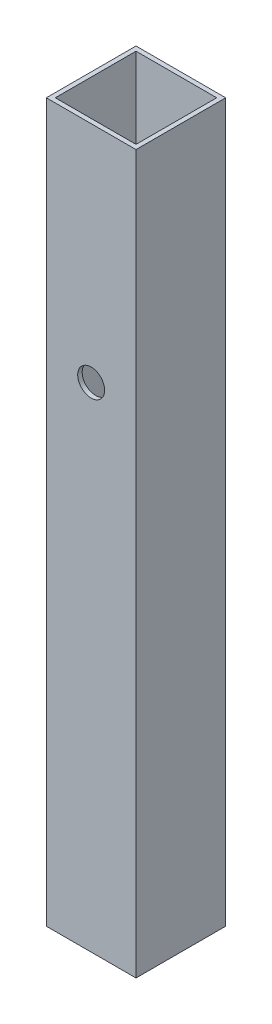
ISO-10303-21;
HEADER;
FILE_DESCRIPTION(('STEP AP214'),'2;1');
FILE_NAME('part.step','',(''),(''),'','','');
FILE_SCHEMA(('AUTOMOTIVE_DESIGN { 1 0 10303 214 1 1 1 1 }'));
ENDSEC;
DATA;
#1=APPLICATION_CONTEXT('core data for automotive mechanical design processes');
#2=APPLICATION_PROTOCOL_DEFINITION('international standard','automotive_design',2000,#1);
#3=PRODUCT_CONTEXT('',#1,'mechanical');
#4=PRODUCT('Part','Part','',(#3));
#5=PRODUCT_RELATED_PRODUCT_CATEGORY('part','',(#4));
#6=PRODUCT_DEFINITION_FORMATION('','',#4);
#7=PRODUCT_DEFINITION_CONTEXT('part definition',#1,'design');
#8=PRODUCT_DEFINITION('design','',#6,#7);
#9=PRODUCT_DEFINITION_SHAPE('','',#8);
#10=(LENGTH_UNIT() NAMED_UNIT(*) SI_UNIT(.MILLI.,.METRE.));
#11=(NAMED_UNIT(*) PLANE_ANGLE_UNIT() SI_UNIT($,.RADIAN.));
#12=(NAMED_UNIT(*) SI_UNIT($,.STERADIAN.) SOLID_ANGLE_UNIT());
#13=UNCERTAINTY_MEASURE_WITH_UNIT(LENGTH_MEASURE(1.E-05),#10,'distance_accuracy_value','');
#14=(GEOMETRIC_REPRESENTATION_CONTEXT(3) GLOBAL_UNCERTAINTY_ASSIGNED_CONTEXT((#13)) GLOBAL_UNIT_ASSIGNED_CONTEXT((#10,
#11,#12)) REPRESENTATION_CONTEXT('',''));
#15=CARTESIAN_POINT('',(0.,0.,0.));
#16=DIRECTION('',(0.,0.,1.));
#17=DIRECTION('',(1.,0.,0.));
#18=AXIS2_PLACEMENT_3D('',#15,#16,#17);
#19=CARTESIAN_POINT('',(0.,140.,0.));
#20=DIRECTION('',(0.,1.,0.));
#21=DIRECTION('',(0.,0.,1.));
#22=AXIS2_PLACEMENT_3D('',#19,#20,#21);
#23=PLANE('',#22);
#24=DIRECTION('',(0.,0.,1.));
#25=VECTOR('',#24,1.);
#26=CARTESIAN_POINT('',(-10.,140.,-10.));
#27=LINE('',#26,#25);
#28=CARTESIAN_POINT('',(-10.,140.,-10.));
#29=VERTEX_POINT('',#28);
#30=CARTESIAN_POINT('',(-9.99999999999999,140.,10.));
#31=VERTEX_POINT('',#30);
#32=EDGE_CURVE('E105',#29,#31,#27,.T.);
#33=ORIENTED_EDGE('',*,*,#32,.T.);
#34=DIRECTION('',(1.,0.,0.));
#35=VECTOR('',#34,1.);
#36=CARTESIAN_POINT('',(-9.99999999999999,140.,10.));
#37=LINE('',#36,#35);
#38=CARTESIAN_POINT('',(10.,140.,10.));
#39=VERTEX_POINT('',#38);
#40=EDGE_CURVE('E158',#31,#39,#37,.T.);
#41=ORIENTED_EDGE('',*,*,#40,.T.);
#42=DIRECTION('',(0.,0.,-1.));
#43=VECTOR('',#42,1.);
#44=CARTESIAN_POINT('',(10.,140.,-10.));
#45=LINE('',#44,#43);
#46=CARTESIAN_POINT('',(10.,140.,-10.));
#47=VERTEX_POINT('',#46);
#48=EDGE_CURVE('E160',#39,#47,#45,.T.);
#49=ORIENTED_EDGE('',*,*,#48,.T.);
#50=DIRECTION('',(-1.,0.,0.));
#51=VECTOR('',#50,1.);
#52=CARTESIAN_POINT('',(-10.,140.,-10.));
#53=LINE('',#52,#51);
#54=EDGE_CURVE('E58',#47,#29,#53,.T.);
#55=ORIENTED_EDGE('',*,*,#54,.T.);
#56=EDGE_LOOP('',(#33,#41,#49,#55));
#57=FACE_BOUND('',#56,.T.);
#58=DIRECTION('',(1.,0.,0.));
#59=VECTOR('',#58,1.);
#60=CARTESIAN_POINT('',(-9.,140.,9.));
#61=LINE('',#60,#59);
#62=CARTESIAN_POINT('',(-9.,140.,9.));
#63=VERTEX_POINT('',#62);
#64=CARTESIAN_POINT('',(9.00000000000001,140.,9.));
#65=VERTEX_POINT('',#64);
#66=EDGE_CURVE('E132',#63,#65,#61,.T.);
#67=ORIENTED_EDGE('',*,*,#66,.F.);
#68=DIRECTION('',(0.,0.,1.));
#69=VECTOR('',#68,1.);
#70=CARTESIAN_POINT('',(-9.,140.,-9.));
#71=LINE('',#70,#69);
#72=CARTESIAN_POINT('',(-9.,140.,-9.));
#73=VERTEX_POINT('',#72);
#74=EDGE_CURVE('E130',#73,#63,#71,.T.);
#75=ORIENTED_EDGE('',*,*,#74,.F.);
#76=DIRECTION('',(-1.,0.,0.));
#77=VECTOR('',#76,1.);
#78=CARTESIAN_POINT('',(-9.,140.,-9.));
#79=LINE('',#78,#77);
#80=CARTESIAN_POINT('',(9.,140.,-9.));
#81=VERTEX_POINT('',#80);
#82=EDGE_CURVE('E137',#81,#73,#79,.T.);
#83=ORIENTED_EDGE('',*,*,#82,.F.);
#84=DIRECTION('',(0.,0.,-1.));
#85=VECTOR('',#84,1.);
#86=CARTESIAN_POINT('',(9.,140.,-9.));
#87=LINE('',#86,#85);
#88=EDGE_CURVE('E135',#65,#81,#87,.T.);
#89=ORIENTED_EDGE('',*,*,#88,.F.);
#90=EDGE_LOOP('',(#67,#75,#83,#89));
#91=FACE_BOUND('',#90,.T.);
#92=ADVANCED_FACE('F34',(#57,#91),#23,.T.);
#93=CARTESIAN_POINT('',(-10.,140.,-10.));
#94=DIRECTION('',(1.,0.,0.));
#95=DIRECTION('',(0.,0.,-1.));
#96=AXIS2_PLACEMENT_3D('',#93,#94,#95);
#97=PLANE('',#96);
#98=DIRECTION('',(0.,-1.,0.));
#99=VECTOR('',#98,1.);
#100=CARTESIAN_POINT('',(-10.,140.,-10.));
#101=LINE('',#100,#99);
#102=CARTESIAN_POINT('',(-9.99999999999999,-20.,-10.));
#103=VERTEX_POINT('',#102);
#104=EDGE_CURVE('E100',#29,#103,#101,.T.);
#105=ORIENTED_EDGE('',*,*,#104,.T.);
#106=DIRECTION('',(0.,0.,-1.));
#107=VECTOR('',#106,1.);
#108=CARTESIAN_POINT('',(-9.99999999999999,-20.,10.));
#109=LINE('',#108,#107);
#110=CARTESIAN_POINT('',(-9.99999999999999,-20.,10.));
#111=VERTEX_POINT('',#110);
#112=EDGE_CURVE('E104',#111,#103,#109,.T.);
#113=ORIENTED_EDGE('',*,*,#112,.F.);
#114=DIRECTION('',(0.,-1.,0.));
#115=VECTOR('',#114,1.);
#116=CARTESIAN_POINT('',(-9.99999999999999,140.,10.));
#117=LINE('',#116,#115);
#118=EDGE_CURVE('E11',#31,#111,#117,.T.);
#119=ORIENTED_EDGE('',*,*,#118,.F.);
#120=ORIENTED_EDGE('',*,*,#32,.F.);
#121=EDGE_LOOP('',(#105,#113,#119,#120));
#122=FACE_BOUND('',#121,.T.);
#123=ADVANCED_FACE('F36',(#122),#97,.F.);
#124=CARTESIAN_POINT('',(-9.99999999999999,140.,10.));
#125=DIRECTION('',(0.,0.,-1.));
#126=DIRECTION('',(-1.,0.,0.));
#127=AXIS2_PLACEMENT_3D('',#124,#125,#126);
#128=PLANE('',#127);
#129=CARTESIAN_POINT('',(0.,90.,10.));
#130=DIRECTION('',(0.,0.,1.));
#131=DIRECTION('',(1.,0.,0.));
#132=AXIS2_PLACEMENT_3D('',#129,#130,#131);
#133=CIRCLE('',#132,3.);
#134=CARTESIAN_POINT('',(3.,90.,10.));
#135=VERTEX_POINT('',#134);
#136=EDGE_CURVE('E124',#135,#135,#133,.T.);
#137=ORIENTED_EDGE('',*,*,#136,.F.);
#138=EDGE_LOOP('',(#137));
#139=FACE_BOUND('',#138,.T.);
#140=ORIENTED_EDGE('',*,*,#118,.T.);
#141=DIRECTION('',(-1.,0.,0.));
#142=VECTOR('',#141,1.);
#143=CARTESIAN_POINT('',(-9.99999999999999,-20.,10.));
#144=LINE('',#143,#142);
#145=CARTESIAN_POINT('',(10.,-20.,10.));
#146=VERTEX_POINT('',#145);
#147=EDGE_CURVE('E121',#146,#111,#144,.T.);
#148=ORIENTED_EDGE('',*,*,#147,.F.);
#149=DIRECTION('',(0.,-1.,0.));
#150=VECTOR('',#149,1.);
#151=CARTESIAN_POINT('',(10.,140.,10.));
#152=LINE('',#151,#150);
#153=EDGE_CURVE('E43',#39,#146,#152,.T.);
#154=ORIENTED_EDGE('',*,*,#153,.F.);
#155=ORIENTED_EDGE('',*,*,#40,.F.);
#156=EDGE_LOOP('',(#140,#148,#154,#155));
#157=FACE_BOUND('',#156,.T.);
#158=ADVANCED_FACE('F169',(#139,#157),#128,.F.);
#159=CARTESIAN_POINT('',(10.,140.,-10.));
#160=DIRECTION('',(-1.,0.,0.));
#161=DIRECTION('',(0.,0.,1.));
#162=AXIS2_PLACEMENT_3D('',#159,#160,#161);
#163=PLANE('',#162);
#164=ORIENTED_EDGE('',*,*,#153,.T.);
#165=DIRECTION('',(0.,0.,1.));
#166=VECTOR('',#165,1.);
#167=CARTESIAN_POINT('',(10.,-20.,10.));
#168=LINE('',#167,#166);
#169=CARTESIAN_POINT('',(10.,-20.,-10.));
#170=VERTEX_POINT('',#169);
#171=EDGE_CURVE('E116',#170,#146,#168,.T.);
#172=ORIENTED_EDGE('',*,*,#171,.F.);
#173=DIRECTION('',(0.,-1.,0.));
#174=VECTOR('',#173,1.);
#175=CARTESIAN_POINT('',(10.,140.,-10.));
#176=LINE('',#175,#174);
#177=EDGE_CURVE('E107',#47,#170,#176,.T.);
#178=ORIENTED_EDGE('',*,*,#177,.F.);
#179=ORIENTED_EDGE('',*,*,#48,.F.);
#180=EDGE_LOOP('',(#164,#172,#178,#179));
#181=FACE_BOUND('',#180,.T.);
#182=ADVANCED_FACE('F167',(#181),#163,.F.);
#183=CARTESIAN_POINT('',(-10.,140.,-10.));
#184=DIRECTION('',(0.,0.,1.));
#185=DIRECTION('',(1.,0.,0.));
#186=AXIS2_PLACEMENT_3D('',#183,#184,#185);
#187=PLANE('',#186);
#188=ORIENTED_EDGE('',*,*,#177,.T.);
#189=DIRECTION('',(1.,0.,0.));
#190=VECTOR('',#189,1.);
#191=CARTESIAN_POINT('',(-9.99999999999999,-20.,-10.));
#192=LINE('',#191,#190);
#193=EDGE_CURVE('E110',#103,#170,#192,.T.);
#194=ORIENTED_EDGE('',*,*,#193,.F.);
#195=ORIENTED_EDGE('',*,*,#104,.F.);
#196=ORIENTED_EDGE('',*,*,#54,.F.);
#197=EDGE_LOOP('',(#188,#194,#195,#196));
#198=FACE_BOUND('',#197,.T.);
#199=ADVANCED_FACE('F111',(#198),#187,.F.);
#200=CARTESIAN_POINT('',(-9.,140.,-9.));
#201=DIRECTION('',(1.,0.,0.));
#202=DIRECTION('',(0.,0.,-1.));
#203=AXIS2_PLACEMENT_3D('',#200,#201,#202);
#204=PLANE('',#203);
#205=DIRECTION('',(0.,0.,1.));
#206=VECTOR('',#205,1.);
#207=CARTESIAN_POINT('',(-9.,0.,-9.));
#208=LINE('',#207,#206);
#209=CARTESIAN_POINT('',(-9.,0.,-9.));
#210=VERTEX_POINT('',#209);
#211=CARTESIAN_POINT('',(-9.,0.,9.));
#212=VERTEX_POINT('',#211);
#213=EDGE_CURVE('E129',#210,#212,#208,.T.);
#214=ORIENTED_EDGE('',*,*,#213,.F.);
#215=DIRECTION('',(0.,-1.,0.));
#216=VECTOR('',#215,1.);
#217=CARTESIAN_POINT('',(-9.,140.,-9.));
#218=LINE('',#217,#216);
#219=EDGE_CURVE('E139',#73,#210,#218,.T.);
#220=ORIENTED_EDGE('',*,*,#219,.F.);
#221=ORIENTED_EDGE('',*,*,#74,.T.);
#222=DIRECTION('',(0.,-1.,0.));
#223=VECTOR('',#222,1.);
#224=CARTESIAN_POINT('',(-9.,140.,9.));
#225=LINE('',#224,#223);
#226=EDGE_CURVE('E154',#63,#212,#225,.T.);
#227=ORIENTED_EDGE('',*,*,#226,.T.);
#228=EDGE_LOOP('',(#214,#220,#221,#227));
#229=FACE_BOUND('',#228,.T.);
#230=ADVANCED_FACE('F188',(#229),#204,.T.);
#231=CARTESIAN_POINT('',(-9.,140.,9.));
#232=DIRECTION('',(0.,0.,-1.));
#233=DIRECTION('',(-1.,0.,0.));
#234=AXIS2_PLACEMENT_3D('',#231,#232,#233);
#235=PLANE('',#234);
#236=CARTESIAN_POINT('',(0.,90.,9.));
#237=DIRECTION('',(0.,0.,-1.));
#238=DIRECTION('',(-1.,0.,0.));
#239=AXIS2_PLACEMENT_3D('',#236,#237,#238);
#240=CIRCLE('',#239,3.);
#241=CARTESIAN_POINT('',(-3.,90.,9.));
#242=VERTEX_POINT('',#241);
#243=EDGE_CURVE('E38',#242,#242,#240,.T.);
#244=ORIENTED_EDGE('',*,*,#243,.F.);
#245=EDGE_LOOP('',(#244));
#246=FACE_BOUND('',#245,.T.);
#247=DIRECTION('',(1.,0.,0.));
#248=VECTOR('',#247,1.);
#249=CARTESIAN_POINT('',(-9.,0.,9.));
#250=LINE('',#249,#248);
#251=CARTESIAN_POINT('',(9.00000000000001,0.,9.));
#252=VERTEX_POINT('',#251);
#253=EDGE_CURVE('E142',#212,#252,#250,.T.);
#254=ORIENTED_EDGE('',*,*,#253,.F.);
#255=ORIENTED_EDGE('',*,*,#226,.F.);
#256=ORIENTED_EDGE('',*,*,#66,.T.);
#257=DIRECTION('',(0.,-1.,0.));
#258=VECTOR('',#257,1.);
#259=CARTESIAN_POINT('',(9.00000000000001,140.,9.));
#260=LINE('',#259,#258);
#261=EDGE_CURVE('E152',#65,#252,#260,.T.);
#262=ORIENTED_EDGE('',*,*,#261,.T.);
#263=EDGE_LOOP('',(#254,#255,#256,#262));
#264=FACE_BOUND('',#263,.T.);
#265=ADVANCED_FACE('F180',(#246,#264),#235,.T.);
#266=CARTESIAN_POINT('',(9.,140.,-9.));
#267=DIRECTION('',(-1.,0.,0.));
#268=DIRECTION('',(0.,0.,1.));
#269=AXIS2_PLACEMENT_3D('',#266,#267,#268);
#270=PLANE('',#269);
#271=DIRECTION('',(0.,0.,-1.));
#272=VECTOR('',#271,1.);
#273=CARTESIAN_POINT('',(9.,0.,-9.));
#274=LINE('',#273,#272);
#275=CARTESIAN_POINT('',(9.,0.,-9.));
#276=VERTEX_POINT('',#275);
#277=EDGE_CURVE('E145',#252,#276,#274,.T.);
#278=ORIENTED_EDGE('',*,*,#277,.F.);
#279=ORIENTED_EDGE('',*,*,#261,.F.);
#280=ORIENTED_EDGE('',*,*,#88,.T.);
#281=DIRECTION('',(0.,-1.,0.));
#282=VECTOR('',#281,1.);
#283=CARTESIAN_POINT('',(9.,140.,-9.));
#284=LINE('',#283,#282);
#285=EDGE_CURVE('E50',#81,#276,#284,.T.);
#286=ORIENTED_EDGE('',*,*,#285,.T.);
#287=EDGE_LOOP('',(#278,#279,#280,#286));
#288=FACE_BOUND('',#287,.T.);
#289=ADVANCED_FACE('F183',(#288),#270,.T.);
#290=CARTESIAN_POINT('',(-9.,140.,-9.));
#291=DIRECTION('',(0.,0.,1.));
#292=DIRECTION('',(1.,0.,0.));
#293=AXIS2_PLACEMENT_3D('',#290,#291,#292);
#294=PLANE('',#293);
#295=DIRECTION('',(-1.,0.,0.));
#296=VECTOR('',#295,1.);
#297=CARTESIAN_POINT('',(-9.,0.,-9.));
#298=LINE('',#297,#296);
#299=EDGE_CURVE('E133',#276,#210,#298,.T.);
#300=ORIENTED_EDGE('',*,*,#299,.F.);
#301=ORIENTED_EDGE('',*,*,#285,.F.);
#302=ORIENTED_EDGE('',*,*,#82,.T.);
#303=ORIENTED_EDGE('',*,*,#219,.T.);
#304=EDGE_LOOP('',(#300,#301,#302,#303));
#305=FACE_BOUND('',#304,.T.);
#306=ADVANCED_FACE('F190',(#305),#294,.T.);
#307=CARTESIAN_POINT('',(0.,0.,0.));
#308=DIRECTION('',(0.,-1.,0.));
#309=DIRECTION('',(0.,0.,-1.));
#310=AXIS2_PLACEMENT_3D('',#307,#308,#309);
#311=PLANE('',#310);
#312=ORIENTED_EDGE('',*,*,#299,.T.);
#313=ORIENTED_EDGE('',*,*,#213,.T.);
#314=ORIENTED_EDGE('',*,*,#253,.T.);
#315=ORIENTED_EDGE('',*,*,#277,.T.);
#316=EDGE_LOOP('',(#312,#313,#314,#315));
#317=FACE_BOUND('',#316,.T.);
#318=ADVANCED_FACE('F185',(#317),#311,.F.);
#319=CARTESIAN_POINT('',(0.,-20.,0.));
#320=DIRECTION('',(0.,-1.,0.));
#321=DIRECTION('',(0.,0.,-1.));
#322=AXIS2_PLACEMENT_3D('',#319,#320,#321);
#323=PLANE('',#322);
#324=ORIENTED_EDGE('',*,*,#112,.T.);
#325=ORIENTED_EDGE('',*,*,#193,.T.);
#326=ORIENTED_EDGE('',*,*,#171,.T.);
#327=ORIENTED_EDGE('',*,*,#147,.T.);
#328=EDGE_LOOP('',(#324,#325,#326,#327));
#329=FACE_BOUND('',#328,.T.);
#330=ADVANCED_FACE('F119',(#329),#323,.T.);
#331=CARTESIAN_POINT('',(0.,90.,8.));
#332=DIRECTION('',(0.,0.,1.));
#333=DIRECTION('',(1.,0.,0.));
#334=AXIS2_PLACEMENT_3D('',#331,#332,#333);
#335=CYLINDRICAL_SURFACE('',#334,3.);
#336=ORIENTED_EDGE('',*,*,#243,.T.);
#337=EDGE_LOOP('',(#336));
#338=FACE_BOUND('',#337,.T.);
#339=ORIENTED_EDGE('',*,*,#136,.T.);
#340=EDGE_LOOP('',(#339));
#341=FACE_BOUND('',#340,.T.);
#342=ADVANCED_FACE('F217',(#338,#341),#335,.F.);
#343=CLOSED_SHELL('',(#92,#123,#158,#182,#199,#230,#265,#289,#306,#318,#330,#342));
#344=MANIFOLD_SOLID_BREP('B2',#343);
#345=ADVANCED_BREP_SHAPE_REPRESENTATION('',(#18,#344),#14);
#346=SHAPE_DEFINITION_REPRESENTATION(#9,#345);
ENDSEC;
END-ISO-10303-21;
